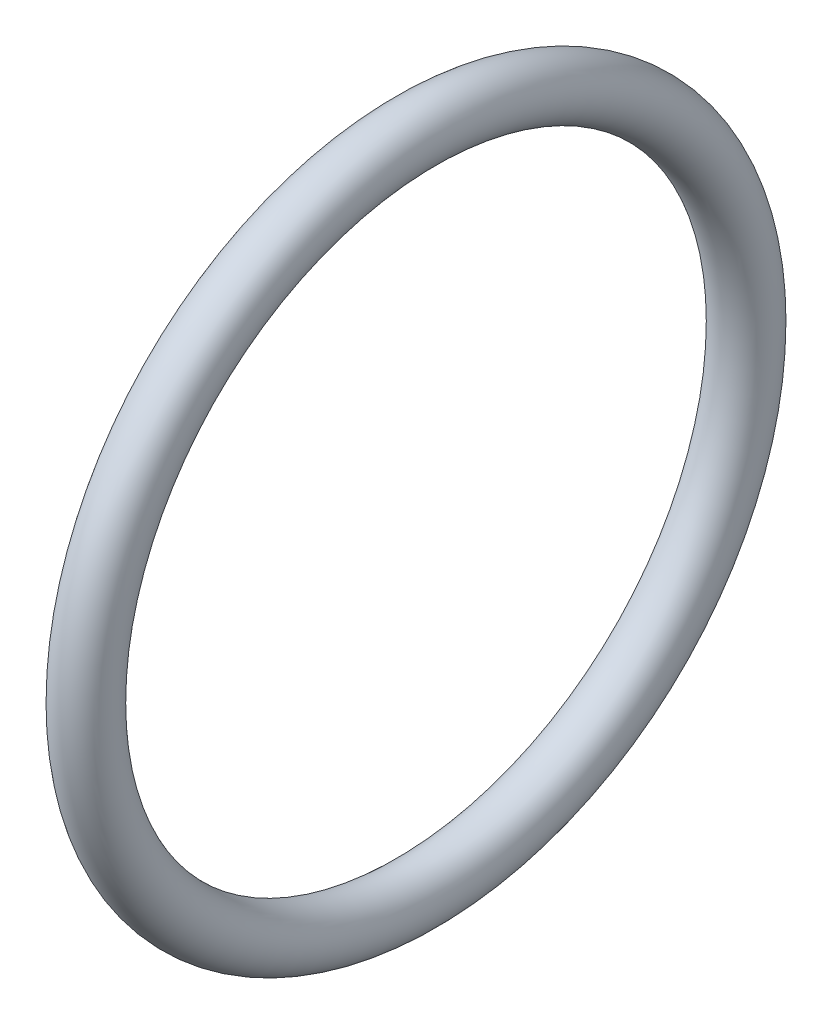
ISO-10303-21;
HEADER;
FILE_DESCRIPTION(('STEP AP214'),'2;1');
FILE_NAME('part.step','',(''),(''),'','','');
FILE_SCHEMA(('AUTOMOTIVE_DESIGN { 1 0 10303 214 1 1 1 1 }'));
ENDSEC;
DATA;
#1=APPLICATION_CONTEXT('core data for automotive mechanical design processes');
#2=APPLICATION_PROTOCOL_DEFINITION('international standard','automotive_design',2000,#1);
#3=PRODUCT_CONTEXT('',#1,'mechanical');
#4=PRODUCT('Part','Part','',(#3));
#5=PRODUCT_RELATED_PRODUCT_CATEGORY('part','',(#4));
#6=PRODUCT_DEFINITION_FORMATION('','',#4);
#7=PRODUCT_DEFINITION_CONTEXT('part definition',#1,'design');
#8=PRODUCT_DEFINITION('design','',#6,#7);
#9=PRODUCT_DEFINITION_SHAPE('','',#8);
#10=(LENGTH_UNIT() NAMED_UNIT(*) SI_UNIT(.MILLI.,.METRE.));
#11=(NAMED_UNIT(*) PLANE_ANGLE_UNIT() SI_UNIT($,.RADIAN.));
#12=(NAMED_UNIT(*) SI_UNIT($,.STERADIAN.) SOLID_ANGLE_UNIT());
#13=UNCERTAINTY_MEASURE_WITH_UNIT(LENGTH_MEASURE(1.E-05),#10,'distance_accuracy_value','');
#14=(GEOMETRIC_REPRESENTATION_CONTEXT(3) GLOBAL_UNCERTAINTY_ASSIGNED_CONTEXT((#13)) GLOBAL_UNIT_ASSIGNED_CONTEXT((#10,
#11,#12)) REPRESENTATION_CONTEXT('',''));
#15=CARTESIAN_POINT('',(0.,0.,0.));
#16=DIRECTION('',(0.,0.,1.));
#17=DIRECTION('',(1.,0.,0.));
#18=AXIS2_PLACEMENT_3D('',#15,#16,#17);
#19=CARTESIAN_POINT('',(17.339799839,0.,0.));
#20=DIRECTION('',(-1.,0.,0.));
#21=DIRECTION('',(0.,0.,1.));
#22=AXIS2_PLACEMENT_3D('',#19,#20,#21);
#23=TOROIDAL_SURFACE('',#22,8.199999983,0.699999996999999);
#24=CARTESIAN_POINT('',(17.339799839,0.,8.89999998));
#25=VERTEX_POINT('',#24);
#26=VERTEX_LOOP('',#25);
#27=FACE_BOUND('',#26,.T.);
#28=ADVANCED_FACE('F33',(#27),#23,.T.);
#29=CLOSED_SHELL('',(#28));
#30=MANIFOLD_SOLID_BREP('B2',#29);
#31=ADVANCED_BREP_SHAPE_REPRESENTATION('',(#18,#30),#14);
#32=SHAPE_DEFINITION_REPRESENTATION(#9,#31);
ENDSEC;
END-ISO-10303-21;
